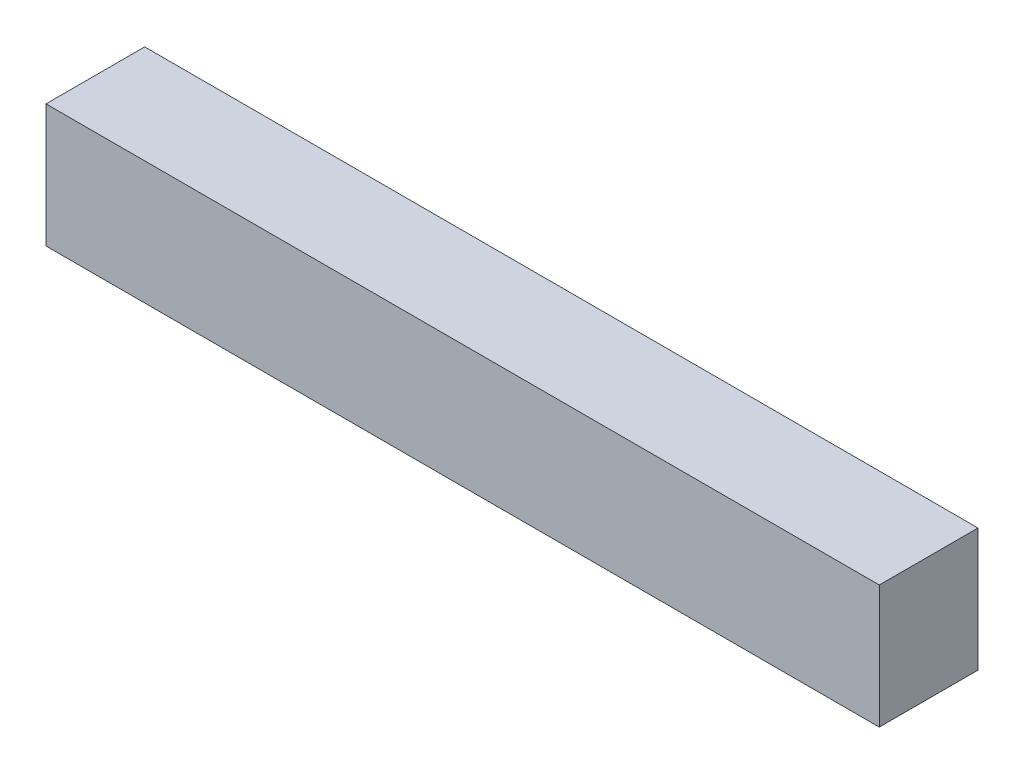
ISO-10303-21;
HEADER;
FILE_DESCRIPTION(('STEP AP214'),'2;1');
FILE_NAME('part.step','',(''),(''),'','','');
FILE_SCHEMA(('AUTOMOTIVE_DESIGN { 1 0 10303 214 1 1 1 1 }'));
ENDSEC;
DATA;
#1=APPLICATION_CONTEXT('core data for automotive mechanical design processes');
#2=APPLICATION_PROTOCOL_DEFINITION('international standard','automotive_design',2000,#1);
#3=PRODUCT_CONTEXT('',#1,'mechanical');
#4=PRODUCT('Part','Part','',(#3));
#5=PRODUCT_RELATED_PRODUCT_CATEGORY('part','',(#4));
#6=PRODUCT_DEFINITION_FORMATION('','',#4);
#7=PRODUCT_DEFINITION_CONTEXT('part definition',#1,'design');
#8=PRODUCT_DEFINITION('design','',#6,#7);
#9=PRODUCT_DEFINITION_SHAPE('','',#8);
#10=(LENGTH_UNIT() NAMED_UNIT(*) SI_UNIT(.MILLI.,.METRE.));
#11=(NAMED_UNIT(*) PLANE_ANGLE_UNIT() SI_UNIT($,.RADIAN.));
#12=(NAMED_UNIT(*) SI_UNIT($,.STERADIAN.) SOLID_ANGLE_UNIT());
#13=UNCERTAINTY_MEASURE_WITH_UNIT(LENGTH_MEASURE(1.E-05),#10,'distance_accuracy_value','');
#14=(GEOMETRIC_REPRESENTATION_CONTEXT(3) GLOBAL_UNCERTAINTY_ASSIGNED_CONTEXT((#13)) GLOBAL_UNIT_ASSIGNED_CONTEXT((#10,
#11,#12)) REPRESENTATION_CONTEXT('',''));
#15=CARTESIAN_POINT('',(0.,0.,0.));
#16=DIRECTION('',(0.,0.,1.));
#17=DIRECTION('',(1.,0.,0.));
#18=AXIS2_PLACEMENT_3D('',#15,#16,#17);
#19=CARTESIAN_POINT('',(0.,0.,0.));
#20=DIRECTION('',(0.,0.,1.));
#21=DIRECTION('',(0.,-1.,0.));
#22=AXIS2_PLACEMENT_3D('',#19,#20,#21);
#23=PLANE('',#22);
#24=DIRECTION('',(0.,-1.,0.));
#25=VECTOR('',#24,1.);
#26=CARTESIAN_POINT('',(-4.4704,0.,0.));
#27=LINE('',#26,#25);
#28=CARTESIAN_POINT('',(-4.4704,0.6604,0.));
#29=VERTEX_POINT('',#28);
#30=CARTESIAN_POINT('',(-4.4704,-0.660399999999999,0.));
#31=VERTEX_POINT('',#30);
#32=EDGE_CURVE('E19',#29,#31,#27,.T.);
#33=ORIENTED_EDGE('',*,*,#32,.F.);
#34=DIRECTION('',(1.,0.,0.));
#35=VECTOR('',#34,1.);
#36=CARTESIAN_POINT('',(4.4704,0.660399999999999,0.));
#37=LINE('',#36,#35);
#38=CARTESIAN_POINT('',(4.4704,0.660399999999999,0.));
#39=VERTEX_POINT('',#38);
#40=EDGE_CURVE('E54',#39,#29,#37,.F.);
#41=ORIENTED_EDGE('',*,*,#40,.F.);
#42=DIRECTION('',(0.,1.,0.));
#43=VECTOR('',#42,1.);
#44=CARTESIAN_POINT('',(4.4704,-0.660400000000001,0.));
#45=LINE('',#44,#43);
#46=CARTESIAN_POINT('',(4.4704,-0.6604,0.));
#47=VERTEX_POINT('',#46);
#48=EDGE_CURVE('E57',#47,#39,#45,.T.);
#49=ORIENTED_EDGE('',*,*,#48,.F.);
#50=DIRECTION('',(1.,0.,0.));
#51=VECTOR('',#50,1.);
#52=CARTESIAN_POINT('',(-4.4704,-0.660399999999999,0.));
#53=LINE('',#52,#51);
#54=EDGE_CURVE('E59',#31,#47,#53,.T.);
#55=ORIENTED_EDGE('',*,*,#54,.F.);
#56=EDGE_LOOP('',(#33,#41,#49,#55));
#57=FACE_BOUND('',#56,.T.);
#58=ADVANCED_FACE('F16',(#57),#23,.F.);
#59=CARTESIAN_POINT('',(-4.4704,-0.660399999999999,0.));
#60=DIRECTION('',(0.,-1.,0.));
#61=DIRECTION('',(0.,0.,-1.));
#62=AXIS2_PLACEMENT_3D('',#59,#60,#61);
#63=PLANE('',#62);
#64=DIRECTION('',(1.,0.,0.));
#65=VECTOR('',#64,1.);
#66=CARTESIAN_POINT('',(0.,-0.660399999999999,1.059));
#67=LINE('',#66,#65);
#68=CARTESIAN_POINT('',(-4.4704,-0.660399999999999,1.059));
#69=VERTEX_POINT('',#68);
#70=CARTESIAN_POINT('',(4.4704,-0.6604,1.059));
#71=VERTEX_POINT('',#70);
#72=EDGE_CURVE('E82',#69,#71,#67,.T.);
#73=ORIENTED_EDGE('',*,*,#72,.F.);
#74=DIRECTION('',(0.,0.,1.));
#75=VECTOR('',#74,1.);
#76=CARTESIAN_POINT('',(-4.4704,-0.660399999999999,0.));
#77=LINE('',#76,#75);
#78=EDGE_CURVE('E70',#31,#69,#77,.T.);
#79=ORIENTED_EDGE('',*,*,#78,.F.);
#80=ORIENTED_EDGE('',*,*,#54,.T.);
#81=DIRECTION('',(0.,0.,-1.));
#82=VECTOR('',#81,1.);
#83=CARTESIAN_POINT('',(4.4704,-0.660400000000001,0.));
#84=LINE('',#83,#82);
#85=EDGE_CURVE('E64',#71,#47,#84,.T.);
#86=ORIENTED_EDGE('',*,*,#85,.F.);
#87=EDGE_LOOP('',(#73,#79,#80,#86));
#88=FACE_BOUND('',#87,.T.);
#89=ADVANCED_FACE('F67',(#88),#63,.T.);
#90=CARTESIAN_POINT('',(4.4704,-0.660400000000001,0.));
#91=DIRECTION('',(1.,0.,0.));
#92=DIRECTION('',(0.,0.,-1.));
#93=AXIS2_PLACEMENT_3D('',#90,#91,#92);
#94=PLANE('',#93);
#95=DIRECTION('',(0.,-1.,0.));
#96=VECTOR('',#95,1.);
#97=CARTESIAN_POINT('',(4.4704,0.,1.059));
#98=LINE('',#97,#96);
#99=CARTESIAN_POINT('',(4.4704,0.660399999999999,1.059));
#100=VERTEX_POINT('',#99);
#101=EDGE_CURVE('E73',#71,#100,#98,.F.);
#102=ORIENTED_EDGE('',*,*,#101,.F.);
#103=ORIENTED_EDGE('',*,*,#85,.T.);
#104=ORIENTED_EDGE('',*,*,#48,.T.);
#105=DIRECTION('',(0.,0.,1.));
#106=VECTOR('',#105,1.);
#107=CARTESIAN_POINT('',(4.4704,0.660399999999999,0.));
#108=LINE('',#107,#106);
#109=EDGE_CURVE('E76',#100,#39,#108,.F.);
#110=ORIENTED_EDGE('',*,*,#109,.F.);
#111=EDGE_LOOP('',(#102,#103,#104,#110));
#112=FACE_BOUND('',#111,.T.);
#113=ADVANCED_FACE('F71',(#112),#94,.T.);
#114=CARTESIAN_POINT('',(4.4704,0.660399999999999,0.));
#115=DIRECTION('',(0.,1.,0.));
#116=DIRECTION('',(0.,0.,1.));
#117=AXIS2_PLACEMENT_3D('',#114,#115,#116);
#118=PLANE('',#117);
#119=DIRECTION('',(1.,0.,0.));
#120=VECTOR('',#119,1.);
#121=CARTESIAN_POINT('',(0.,0.660399999999999,1.059));
#122=LINE('',#121,#120);
#123=CARTESIAN_POINT('',(-4.4704,0.660400000000001,1.059));
#124=VERTEX_POINT('',#123);
#125=EDGE_CURVE('E25',#100,#124,#122,.F.);
#126=ORIENTED_EDGE('',*,*,#125,.F.);
#127=ORIENTED_EDGE('',*,*,#109,.T.);
#128=ORIENTED_EDGE('',*,*,#40,.T.);
#129=DIRECTION('',(0.,0.,1.));
#130=VECTOR('',#129,1.);
#131=CARTESIAN_POINT('',(-4.4704,0.660400000000001,0.));
#132=LINE('',#131,#130);
#133=EDGE_CURVE('E34',#124,#29,#132,.F.);
#134=ORIENTED_EDGE('',*,*,#133,.F.);
#135=EDGE_LOOP('',(#126,#127,#128,#134));
#136=FACE_BOUND('',#135,.T.);
#137=ADVANCED_FACE('F88',(#136),#118,.T.);
#138=CARTESIAN_POINT('',(-4.4704,0.660400000000001,0.));
#139=DIRECTION('',(-1.,0.,0.));
#140=DIRECTION('',(0.,0.,1.));
#141=AXIS2_PLACEMENT_3D('',#138,#139,#140);
#142=PLANE('',#141);
#143=DIRECTION('',(0.,-1.,0.));
#144=VECTOR('',#143,1.);
#145=CARTESIAN_POINT('',(-4.4704,0.,1.059));
#146=LINE('',#145,#144);
#147=EDGE_CURVE('E11',#124,#69,#146,.T.);
#148=ORIENTED_EDGE('',*,*,#147,.F.);
#149=ORIENTED_EDGE('',*,*,#133,.T.);
#150=ORIENTED_EDGE('',*,*,#32,.T.);
#151=ORIENTED_EDGE('',*,*,#78,.T.);
#152=EDGE_LOOP('',(#148,#149,#150,#151));
#153=FACE_BOUND('',#152,.T.);
#154=ADVANCED_FACE('F90',(#153),#142,.T.);
#155=CARTESIAN_POINT('',(0.,0.,1.059));
#156=DIRECTION('',(0.,0.,1.));
#157=DIRECTION('',(0.,-1.,0.));
#158=AXIS2_PLACEMENT_3D('',#155,#156,#157);
#159=PLANE('',#158);
#160=ORIENTED_EDGE('',*,*,#125,.T.);
#161=ORIENTED_EDGE('',*,*,#147,.T.);
#162=ORIENTED_EDGE('',*,*,#72,.T.);
#163=ORIENTED_EDGE('',*,*,#101,.T.);
#164=EDGE_LOOP('',(#160,#161,#162,#163));
#165=FACE_BOUND('',#164,.T.);
#166=ADVANCED_FACE('F87',(#165),#159,.T.);
#167=CLOSED_SHELL('',(#58,#89,#113,#137,#154,#166));
#168=MANIFOLD_SOLID_BREP('B1',#167);
#169=ADVANCED_BREP_SHAPE_REPRESENTATION('',(#18,#168),#14);
#170=SHAPE_DEFINITION_REPRESENTATION(#9,#169);
ENDSEC;
END-ISO-10303-21;
